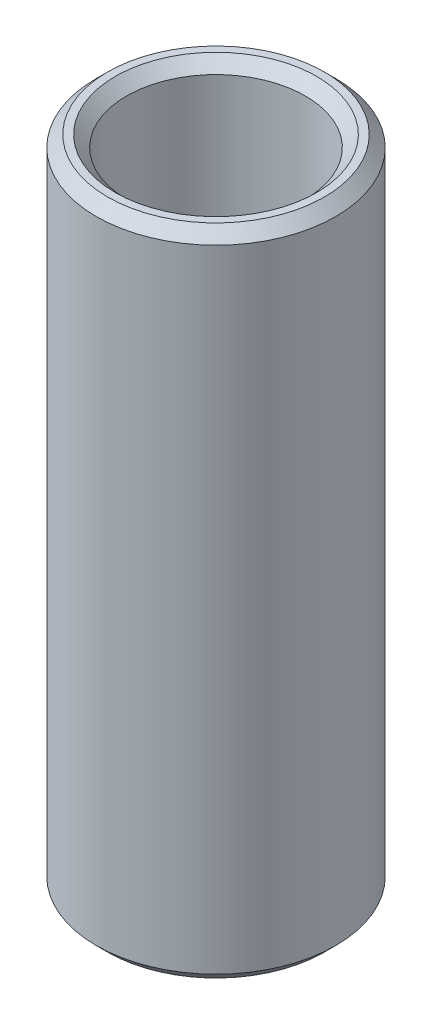
ISO-10303-21;
HEADER;
FILE_DESCRIPTION(('STEP AP214'),'2;1');
FILE_NAME('part.step','',(''),(''),'','','');
FILE_SCHEMA(('AUTOMOTIVE_DESIGN { 1 0 10303 214 1 1 1 1 }'));
ENDSEC;
DATA;
#1=APPLICATION_CONTEXT('core data for automotive mechanical design processes');
#2=APPLICATION_PROTOCOL_DEFINITION('international standard','automotive_design',2000,#1);
#3=PRODUCT_CONTEXT('',#1,'mechanical');
#4=PRODUCT('Part','Part','',(#3));
#5=PRODUCT_RELATED_PRODUCT_CATEGORY('part','',(#4));
#6=PRODUCT_DEFINITION_FORMATION('','',#4);
#7=PRODUCT_DEFINITION_CONTEXT('part definition',#1,'design');
#8=PRODUCT_DEFINITION('design','',#6,#7);
#9=PRODUCT_DEFINITION_SHAPE('','',#8);
#10=(LENGTH_UNIT() NAMED_UNIT(*) SI_UNIT(.MILLI.,.METRE.));
#11=(NAMED_UNIT(*) PLANE_ANGLE_UNIT() SI_UNIT($,.RADIAN.));
#12=(NAMED_UNIT(*) SI_UNIT($,.STERADIAN.) SOLID_ANGLE_UNIT());
#13=UNCERTAINTY_MEASURE_WITH_UNIT(LENGTH_MEASURE(1.E-05),#10,'distance_accuracy_value','');
#14=(GEOMETRIC_REPRESENTATION_CONTEXT(3) GLOBAL_UNCERTAINTY_ASSIGNED_CONTEXT((#13)) GLOBAL_UNIT_ASSIGNED_CONTEXT((#10,
#11,#12)) REPRESENTATION_CONTEXT('',''));
#15=CARTESIAN_POINT('',(0.,0.,0.));
#16=DIRECTION('',(0.,0.,1.));
#17=DIRECTION('',(1.,0.,0.));
#18=AXIS2_PLACEMENT_3D('',#15,#16,#17);
#19=CARTESIAN_POINT('',(0.,122.955161222195,0.));
#20=DIRECTION('',(0.,-1.,0.));
#21=DIRECTION('',(0.,0.,-1.));
#22=AXIS2_PLACEMENT_3D('',#19,#20,#21);
#23=CYLINDRICAL_SURFACE('',#22,22.5);
#24=CARTESIAN_POINT('',(0.,2.1264508799452,0.));
#25=DIRECTION('',(0.,1.,0.));
#26=DIRECTION('',(0.,0.,1.));
#27=AXIS2_PLACEMENT_3D('',#24,#25,#26);
#28=CIRCLE('',#27,22.5);
#29=CARTESIAN_POINT('',(0.,2.1264508799452,22.5));
#30=VERTEX_POINT('',#29);
#31=EDGE_CURVE('E10',#30,#30,#28,.T.);
#32=ORIENTED_EDGE('',*,*,#31,.T.);
#33=EDGE_LOOP('',(#32));
#34=FACE_BOUND('',#33,.T.);
#35=CARTESIAN_POINT('',(0.,120.82871034225,0.));
#36=DIRECTION('',(0.,1.,0.));
#37=DIRECTION('',(0.,0.,1.));
#38=AXIS2_PLACEMENT_3D('',#35,#36,#37);
#39=CIRCLE('',#38,22.5);
#40=CARTESIAN_POINT('',(0.,120.82871034225,22.5));
#41=VERTEX_POINT('',#40);
#42=EDGE_CURVE('E50',#41,#41,#39,.F.);
#43=ORIENTED_EDGE('',*,*,#42,.T.);
#44=EDGE_LOOP('',(#43));
#45=FACE_BOUND('',#44,.T.);
#46=ADVANCED_FACE('F39',(#34,#45),#23,.T.);
#47=CARTESIAN_POINT('',(0.,122.955161222195,0.));
#48=DIRECTION('',(0.,1.,0.));
#49=DIRECTION('',(0.,0.,1.));
#50=AXIS2_PLACEMENT_3D('',#47,#48,#49);
#51=PLANE('',#50);
#52=CARTESIAN_POINT('',(0.,122.955161222195,0.));
#53=DIRECTION('',(0.,1.,0.));
#54=DIRECTION('',(0.,0.,1.));
#55=AXIS2_PLACEMENT_3D('',#52,#53,#54);
#56=CIRCLE('',#55,18.931226354459);
#57=CARTESIAN_POINT('',(0.,122.955161222195,18.931226354459));
#58=VERTEX_POINT('',#57);
#59=EDGE_CURVE('E58',#58,#58,#56,.F.);
#60=ORIENTED_EDGE('',*,*,#59,.T.);
#61=EDGE_LOOP('',(#60));
#62=FACE_BOUND('',#61,.T.);
#63=CARTESIAN_POINT('',(0.,122.955161222195,0.));
#64=DIRECTION('',(0.,1.,0.));
#65=DIRECTION('',(0.,0.,1.));
#66=AXIS2_PLACEMENT_3D('',#63,#64,#65);
#67=CIRCLE('',#66,20.3735491200548);
#68=CARTESIAN_POINT('',(0.,122.955161222195,20.3735491200548));
#69=VERTEX_POINT('',#68);
#70=EDGE_CURVE('E61',#69,#69,#67,.T.);
#71=ORIENTED_EDGE('',*,*,#70,.T.);
#72=EDGE_LOOP('',(#71));
#73=FACE_BOUND('',#72,.T.);
#74=ADVANCED_FACE('F88',(#62,#73),#51,.T.);
#75=CARTESIAN_POINT('',(0.,0.,0.));
#76=DIRECTION('',(0.,1.,0.));
#77=DIRECTION('',(0.,0.,1.));
#78=AXIS2_PLACEMENT_3D('',#75,#76,#77);
#79=PLANE('',#78);
#80=CARTESIAN_POINT('',(0.,0.,0.));
#81=DIRECTION('',(0.,1.,0.));
#82=DIRECTION('',(0.,0.,1.));
#83=AXIS2_PLACEMENT_3D('',#80,#81,#82);
#84=CIRCLE('',#83,18.931226354459);
#85=CARTESIAN_POINT('',(0.,0.,18.931226354459));
#86=VERTEX_POINT('',#85);
#87=EDGE_CURVE('E51',#86,#86,#84,.T.);
#88=ORIENTED_EDGE('',*,*,#87,.T.);
#89=EDGE_LOOP('',(#88));
#90=FACE_BOUND('',#89,.T.);
#91=CARTESIAN_POINT('',(0.,0.,0.));
#92=DIRECTION('',(0.,1.,0.));
#93=DIRECTION('',(0.,0.,1.));
#94=AXIS2_PLACEMENT_3D('',#91,#92,#93);
#95=CIRCLE('',#94,20.3735491200548);
#96=CARTESIAN_POINT('',(0.,0.,20.3735491200548));
#97=VERTEX_POINT('',#96);
#98=EDGE_CURVE('E54',#97,#97,#95,.F.);
#99=ORIENTED_EDGE('',*,*,#98,.T.);
#100=EDGE_LOOP('',(#99));
#101=FACE_BOUND('',#100,.T.);
#102=ADVANCED_FACE('F83',(#90,#101),#79,.F.);
#103=CARTESIAN_POINT('',(0.,122.955161222195,0.));
#104=DIRECTION('',(0.,-1.,0.));
#105=DIRECTION('',(0.,0.,-1.));
#106=AXIS2_PLACEMENT_3D('',#103,#104,#105);
#107=CYLINDRICAL_SURFACE('',#106,16.8047754745137);
#108=CARTESIAN_POINT('',(0.,120.82871034225,0.));
#109=DIRECTION('',(0.,1.,0.));
#110=DIRECTION('',(0.,0.,1.));
#111=AXIS2_PLACEMENT_3D('',#108,#109,#110);
#112=CIRCLE('',#111,16.8047754745137);
#113=CARTESIAN_POINT('',(0.,120.82871034225,16.8047754745137));
#114=VERTEX_POINT('',#113);
#115=EDGE_CURVE('E67',#114,#114,#112,.T.);
#116=ORIENTED_EDGE('',*,*,#115,.T.);
#117=EDGE_LOOP('',(#116));
#118=FACE_BOUND('',#117,.T.);
#119=CARTESIAN_POINT('',(0.,2.12645087994523,0.));
#120=DIRECTION('',(0.,1.,0.));
#121=DIRECTION('',(0.,0.,1.));
#122=AXIS2_PLACEMENT_3D('',#119,#120,#121);
#123=CIRCLE('',#122,16.8047754745137);
#124=CARTESIAN_POINT('',(0.,2.12645087994523,16.8047754745137));
#125=VERTEX_POINT('',#124);
#126=EDGE_CURVE('E69',#125,#125,#123,.F.);
#127=ORIENTED_EDGE('',*,*,#126,.T.);
#128=EDGE_LOOP('',(#127));
#129=FACE_BOUND('',#128,.T.);
#130=ADVANCED_FACE('F71',(#118,#129),#107,.F.);
#131=CARTESIAN_POINT('',(0.,120.82871034225,0.));
#132=DIRECTION('',(0.,1.,0.));
#133=DIRECTION('',(0.,0.,1.));
#134=AXIS2_PLACEMENT_3D('',#131,#132,#133);
#135=CONICAL_SURFACE('',#134,16.8047754745137,0.785398163397459);
#136=ORIENTED_EDGE('',*,*,#59,.F.);
#137=EDGE_LOOP('',(#136));
#138=FACE_BOUND('',#137,.T.);
#139=ORIENTED_EDGE('',*,*,#115,.F.);
#140=EDGE_LOOP('',(#139));
#141=FACE_BOUND('',#140,.T.);
#142=ADVANCED_FACE('F77',(#138,#141),#135,.F.);
#143=CARTESIAN_POINT('',(0.,0.,0.));
#144=DIRECTION('',(0.,-1.,0.));
#145=DIRECTION('',(0.,0.,-1.));
#146=AXIS2_PLACEMENT_3D('',#143,#144,#145);
#147=CONICAL_SURFACE('',#146,18.931226354459,0.785398163397446);
#148=ORIENTED_EDGE('',*,*,#126,.F.);
#149=EDGE_LOOP('',(#148));
#150=FACE_BOUND('',#149,.T.);
#151=ORIENTED_EDGE('',*,*,#87,.F.);
#152=EDGE_LOOP('',(#151));
#153=FACE_BOUND('',#152,.T.);
#154=ADVANCED_FACE('F73',(#150,#153),#147,.F.);
#155=CARTESIAN_POINT('',(0.,2.1264508799452,0.));
#156=DIRECTION('',(0.,1.,0.));
#157=DIRECTION('',(0.,0.,1.));
#158=AXIS2_PLACEMENT_3D('',#155,#156,#157);
#159=CONICAL_SURFACE('',#158,22.5,0.785398163397458);
#160=ORIENTED_EDGE('',*,*,#98,.F.);
#161=EDGE_LOOP('',(#160));
#162=FACE_BOUND('',#161,.T.);
#163=ORIENTED_EDGE('',*,*,#31,.F.);
#164=EDGE_LOOP('',(#163));
#165=FACE_BOUND('',#164,.T.);
#166=ADVANCED_FACE('F76',(#162,#165),#159,.T.);
#167=CARTESIAN_POINT('',(0.,122.955161222195,0.));
#168=DIRECTION('',(0.,-1.,0.));
#169=DIRECTION('',(0.,0.,-1.));
#170=AXIS2_PLACEMENT_3D('',#167,#168,#169);
#171=CONICAL_SURFACE('',#170,20.3735491200548,0.785398163397441);
#172=ORIENTED_EDGE('',*,*,#42,.F.);
#173=EDGE_LOOP('',(#172));
#174=FACE_BOUND('',#173,.T.);
#175=ORIENTED_EDGE('',*,*,#70,.F.);
#176=EDGE_LOOP('',(#175));
#177=FACE_BOUND('',#176,.T.);
#178=ADVANCED_FACE('F45',(#174,#177),#171,.T.);
#179=CLOSED_SHELL('',(#46,#74,#102,#130,#142,#154,#166,#178));
#180=MANIFOLD_SOLID_BREP('B2',#179);
#181=ADVANCED_BREP_SHAPE_REPRESENTATION('',(#18,#180),#14);
#182=SHAPE_DEFINITION_REPRESENTATION(#9,#181);
ENDSEC;
END-ISO-10303-21;
